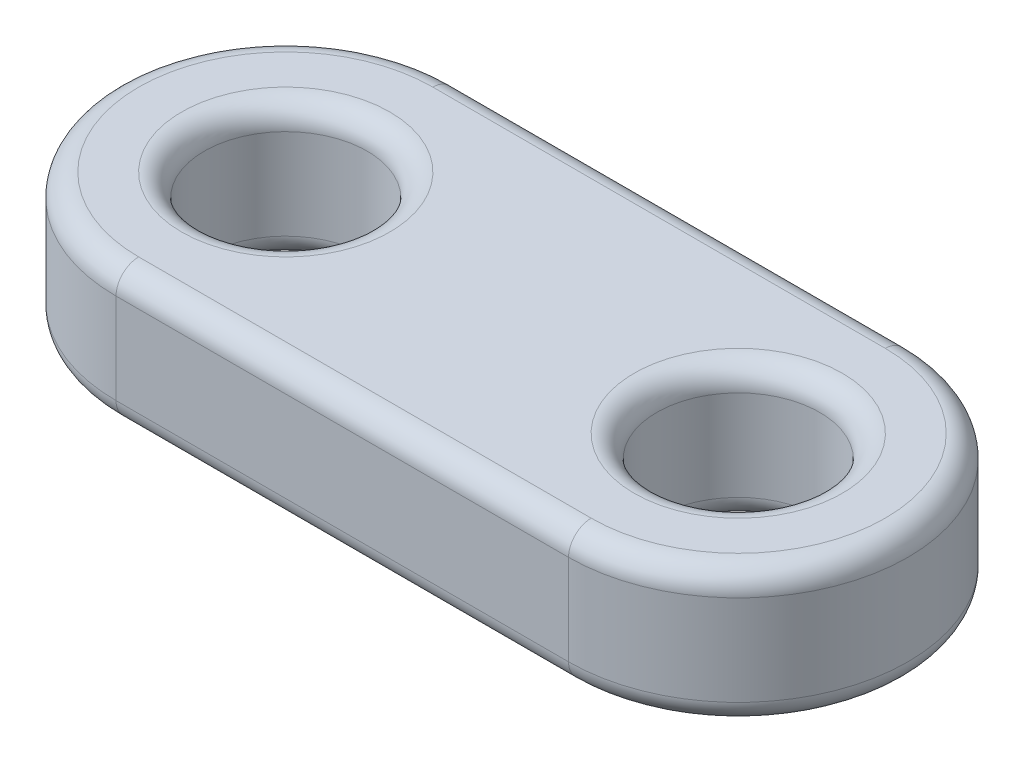
ISO-10303-21;
HEADER;
FILE_DESCRIPTION(('STEP AP214'),'2;1');
FILE_NAME('part.step','',(''),(''),'','','');
FILE_SCHEMA(('AUTOMOTIVE_DESIGN { 1 0 10303 214 1 1 1 1 }'));
ENDSEC;
DATA;
#1=APPLICATION_CONTEXT('core data for automotive mechanical design processes');
#2=APPLICATION_PROTOCOL_DEFINITION('international standard','automotive_design',2000,#1);
#3=PRODUCT_CONTEXT('',#1,'mechanical');
#4=PRODUCT('Part','Part','',(#3));
#5=PRODUCT_RELATED_PRODUCT_CATEGORY('part','',(#4));
#6=PRODUCT_DEFINITION_FORMATION('','',#4);
#7=PRODUCT_DEFINITION_CONTEXT('part definition',#1,'design');
#8=PRODUCT_DEFINITION('design','',#6,#7);
#9=PRODUCT_DEFINITION_SHAPE('','',#8);
#10=(LENGTH_UNIT() NAMED_UNIT(*) SI_UNIT(.MILLI.,.METRE.));
#11=(NAMED_UNIT(*) PLANE_ANGLE_UNIT() SI_UNIT($,.RADIAN.));
#12=(NAMED_UNIT(*) SI_UNIT($,.STERADIAN.) SOLID_ANGLE_UNIT());
#13=UNCERTAINTY_MEASURE_WITH_UNIT(LENGTH_MEASURE(1.E-05),#10,'distance_accuracy_value','');
#14=(GEOMETRIC_REPRESENTATION_CONTEXT(3) GLOBAL_UNCERTAINTY_ASSIGNED_CONTEXT((#13)) GLOBAL_UNIT_ASSIGNED_CONTEXT((#10,
#11,#12)) REPRESENTATION_CONTEXT('',''));
#15=CARTESIAN_POINT('',(0.,0.,0.));
#16=DIRECTION('',(0.,0.,1.));
#17=DIRECTION('',(1.,0.,0.));
#18=AXIS2_PLACEMENT_3D('',#15,#16,#17);
#19=CARTESIAN_POINT('',(-5.,3.,0.));
#20=DIRECTION('',(0.,-1.,0.));
#21=DIRECTION('',(0.,0.,-1.));
#22=AXIS2_PLACEMENT_3D('',#19,#20,#21);
#23=CYLINDRICAL_SURFACE('',#22,3.75);
#24=DIRECTION('',(0.,-1.,0.));
#25=VECTOR('',#24,1.);
#26=CARTESIAN_POINT('',(-5.,3.,-3.75));
#27=LINE('',#26,#25);
#28=CARTESIAN_POINT('',(-5.,2.5,-3.75));
#29=VERTEX_POINT('',#28);
#30=CARTESIAN_POINT('',(-5.,0.5,-3.75));
#31=VERTEX_POINT('',#30);
#32=EDGE_CURVE('E178',#29,#31,#27,.T.);
#33=ORIENTED_EDGE('',*,*,#32,.T.);
#34=CARTESIAN_POINT('',(-5.,0.5,0.));
#35=DIRECTION('',(0.,1.,0.));
#36=DIRECTION('',(0.,0.,1.));
#37=AXIS2_PLACEMENT_3D('',#34,#35,#36);
#38=CIRCLE('',#37,3.75);
#39=CARTESIAN_POINT('',(-5.,0.5,3.75));
#40=VERTEX_POINT('',#39);
#41=EDGE_CURVE('E215',#31,#40,#38,.T.);
#42=ORIENTED_EDGE('',*,*,#41,.T.);
#43=DIRECTION('',(0.,-1.,0.));
#44=VECTOR('',#43,1.);
#45=CARTESIAN_POINT('',(-5.,3.,3.75));
#46=LINE('',#45,#44);
#47=CARTESIAN_POINT('',(-5.,2.5,3.75));
#48=VERTEX_POINT('',#47);
#49=EDGE_CURVE('E146',#48,#40,#46,.T.);
#50=ORIENTED_EDGE('',*,*,#49,.F.);
#51=CARTESIAN_POINT('',(-5.,2.5,0.));
#52=DIRECTION('',(0.,1.,0.));
#53=DIRECTION('',(0.,0.,1.));
#54=AXIS2_PLACEMENT_3D('',#51,#52,#53);
#55=CIRCLE('',#54,3.75);
#56=EDGE_CURVE('E218',#48,#29,#55,.F.);
#57=ORIENTED_EDGE('',*,*,#56,.T.);
#58=EDGE_LOOP('',(#33,#42,#50,#57));
#59=FACE_BOUND('',#58,.T.);
#60=ADVANCED_FACE('F42',(#59),#23,.T.);
#61=CARTESIAN_POINT('',(-5.,3.,3.75));
#62=DIRECTION('',(0.,0.,-1.));
#63=DIRECTION('',(-1.,0.,0.));
#64=AXIS2_PLACEMENT_3D('',#61,#62,#63);
#65=PLANE('',#64);
#66=ORIENTED_EDGE('',*,*,#49,.T.);
#67=DIRECTION('',(1.,0.,0.));
#68=VECTOR('',#67,1.);
#69=CARTESIAN_POINT('',(-5.,0.5,3.75));
#70=LINE('',#69,#68);
#71=CARTESIAN_POINT('',(5.,0.5,3.75));
#72=VERTEX_POINT('',#71);
#73=EDGE_CURVE('E144',#40,#72,#70,.T.);
#74=ORIENTED_EDGE('',*,*,#73,.T.);
#75=DIRECTION('',(0.,-1.,0.));
#76=VECTOR('',#75,1.);
#77=CARTESIAN_POINT('',(5.,3.,3.75));
#78=LINE('',#77,#76);
#79=CARTESIAN_POINT('',(5.,2.5,3.75));
#80=VERTEX_POINT('',#79);
#81=EDGE_CURVE('E126',#80,#72,#78,.T.);
#82=ORIENTED_EDGE('',*,*,#81,.F.);
#83=DIRECTION('',(1.,0.,0.));
#84=VECTOR('',#83,1.);
#85=CARTESIAN_POINT('',(-5.,2.5,3.75));
#86=LINE('',#85,#84);
#87=EDGE_CURVE('E141',#80,#48,#86,.F.);
#88=ORIENTED_EDGE('',*,*,#87,.T.);
#89=EDGE_LOOP('',(#66,#74,#82,#88));
#90=FACE_BOUND('',#89,.T.);
#91=ADVANCED_FACE('F140',(#90),#65,.F.);
#92=CARTESIAN_POINT('',(5.,3.,0.));
#93=DIRECTION('',(0.,-1.,0.));
#94=DIRECTION('',(0.,0.,-1.));
#95=AXIS2_PLACEMENT_3D('',#92,#93,#94);
#96=CYLINDRICAL_SURFACE('',#95,3.75);
#97=ORIENTED_EDGE('',*,*,#81,.T.);
#98=CARTESIAN_POINT('',(5.,0.5,0.));
#99=DIRECTION('',(0.,1.,0.));
#100=DIRECTION('',(0.,0.,1.));
#101=AXIS2_PLACEMENT_3D('',#98,#99,#100);
#102=CIRCLE('',#101,3.75);
#103=CARTESIAN_POINT('',(5.,0.5,-3.75));
#104=VERTEX_POINT('',#103);
#105=EDGE_CURVE('E133',#72,#104,#102,.T.);
#106=ORIENTED_EDGE('',*,*,#105,.T.);
#107=DIRECTION('',(0.,-1.,0.));
#108=VECTOR('',#107,1.);
#109=CARTESIAN_POINT('',(5.,3.,-3.75));
#110=LINE('',#109,#108);
#111=CARTESIAN_POINT('',(5.,2.5,-3.75));
#112=VERTEX_POINT('',#111);
#113=EDGE_CURVE('E128',#112,#104,#110,.T.);
#114=ORIENTED_EDGE('',*,*,#113,.F.);
#115=CARTESIAN_POINT('',(5.,2.5,0.));
#116=DIRECTION('',(0.,1.,0.));
#117=DIRECTION('',(0.,0.,1.));
#118=AXIS2_PLACEMENT_3D('',#115,#116,#117);
#119=CIRCLE('',#118,3.75);
#120=EDGE_CURVE('E123',#112,#80,#119,.F.);
#121=ORIENTED_EDGE('',*,*,#120,.T.);
#122=EDGE_LOOP('',(#97,#106,#114,#121));
#123=FACE_BOUND('',#122,.T.);
#124=ADVANCED_FACE('F125',(#123),#96,.T.);
#125=CARTESIAN_POINT('',(-5.,3.,-3.75));
#126=DIRECTION('',(0.,0.,1.));
#127=DIRECTION('',(1.,0.,0.));
#128=AXIS2_PLACEMENT_3D('',#125,#126,#127);
#129=PLANE('',#128);
#130=ORIENTED_EDGE('',*,*,#113,.T.);
#131=DIRECTION('',(-1.,0.,0.));
#132=VECTOR('',#131,1.);
#133=CARTESIAN_POINT('',(-5.,0.5,-3.75));
#134=LINE('',#133,#132);
#135=EDGE_CURVE('E220',#104,#31,#134,.T.);
#136=ORIENTED_EDGE('',*,*,#135,.T.);
#137=ORIENTED_EDGE('',*,*,#32,.F.);
#138=DIRECTION('',(-1.,0.,0.));
#139=VECTOR('',#138,1.);
#140=CARTESIAN_POINT('',(5.,2.5,-3.75));
#141=LINE('',#140,#139);
#142=EDGE_CURVE('E223',#29,#112,#141,.F.);
#143=ORIENTED_EDGE('',*,*,#142,.T.);
#144=EDGE_LOOP('',(#130,#136,#137,#143));
#145=FACE_BOUND('',#144,.T.);
#146=ADVANCED_FACE('F278',(#145),#129,.F.);
#147=CARTESIAN_POINT('',(-5.,3.,0.));
#148=DIRECTION('',(0.,1.,0.));
#149=DIRECTION('',(0.,0.,1.));
#150=AXIS2_PLACEMENT_3D('',#147,#148,#149);
#151=PLANE('',#150);
#152=CARTESIAN_POINT('',(5.,3.,0.));
#153=DIRECTION('',(0.,1.,0.));
#154=DIRECTION('',(0.,0.,1.));
#155=AXIS2_PLACEMENT_3D('',#152,#153,#154);
#156=CIRCLE('',#155,3.25);
#157=CARTESIAN_POINT('',(5.,3.,3.25));
#158=VERTEX_POINT('',#157);
#159=CARTESIAN_POINT('',(5.,3.,-3.25));
#160=VERTEX_POINT('',#159);
#161=EDGE_CURVE('E52',#158,#160,#156,.T.);
#162=ORIENTED_EDGE('',*,*,#161,.T.);
#163=DIRECTION('',(-1.,0.,0.));
#164=VECTOR('',#163,1.);
#165=CARTESIAN_POINT('',(-5.,3.,-3.25));
#166=LINE('',#165,#164);
#167=CARTESIAN_POINT('',(-5.,3.,-3.25));
#168=VERTEX_POINT('',#167);
#169=EDGE_CURVE('E11',#160,#168,#166,.T.);
#170=ORIENTED_EDGE('',*,*,#169,.T.);
#171=CARTESIAN_POINT('',(-5.,3.,0.));
#172=DIRECTION('',(0.,1.,0.));
#173=DIRECTION('',(0.,0.,1.));
#174=AXIS2_PLACEMENT_3D('',#171,#172,#173);
#175=CIRCLE('',#174,3.25);
#176=CARTESIAN_POINT('',(-5.,3.,3.25));
#177=VERTEX_POINT('',#176);
#178=EDGE_CURVE('E189',#168,#177,#175,.T.);
#179=ORIENTED_EDGE('',*,*,#178,.T.);
#180=DIRECTION('',(1.,0.,0.));
#181=VECTOR('',#180,1.);
#182=CARTESIAN_POINT('',(5.,3.,3.25));
#183=LINE('',#182,#181);
#184=EDGE_CURVE('E69',#177,#158,#183,.T.);
#185=ORIENTED_EDGE('',*,*,#184,.T.);
#186=EDGE_LOOP('',(#162,#170,#179,#185));
#187=FACE_BOUND('',#186,.T.);
#188=CARTESIAN_POINT('',(5.,3.,0.));
#189=DIRECTION('',(0.,1.,0.));
#190=DIRECTION('',(0.,0.,1.));
#191=AXIS2_PLACEMENT_3D('',#188,#189,#190);
#192=CIRCLE('',#191,2.29999999999999);
#193=CARTESIAN_POINT('',(5.,3.,2.29999999999999));
#194=VERTEX_POINT('',#193);
#195=EDGE_CURVE('E191',#194,#194,#192,.F.);
#196=ORIENTED_EDGE('',*,*,#195,.T.);
#197=EDGE_LOOP('',(#196));
#198=FACE_BOUND('',#197,.T.);
#199=CARTESIAN_POINT('',(-5.,3.,0.));
#200=DIRECTION('',(0.,1.,0.));
#201=DIRECTION('',(0.,0.,1.));
#202=AXIS2_PLACEMENT_3D('',#199,#200,#201);
#203=CIRCLE('',#202,2.29999999999999);
#204=CARTESIAN_POINT('',(-5.,3.,2.29999999999999));
#205=VERTEX_POINT('',#204);
#206=EDGE_CURVE('E195',#205,#205,#203,.F.);
#207=ORIENTED_EDGE('',*,*,#206,.T.);
#208=EDGE_LOOP('',(#207));
#209=FACE_BOUND('',#208,.T.);
#210=ADVANCED_FACE('F284',(#187,#198,#209),#151,.T.);
#211=CARTESIAN_POINT('',(-5.,0.,0.));
#212=DIRECTION('',(0.,1.,0.));
#213=DIRECTION('',(0.,0.,1.));
#214=AXIS2_PLACEMENT_3D('',#211,#212,#213);
#215=PLANE('',#214);
#216=CARTESIAN_POINT('',(5.,0.,0.));
#217=DIRECTION('',(0.,1.,0.));
#218=DIRECTION('',(0.,0.,1.));
#219=AXIS2_PLACEMENT_3D('',#216,#217,#218);
#220=CIRCLE('',#219,3.25);
#221=CARTESIAN_POINT('',(5.,0.,-3.25));
#222=VERTEX_POINT('',#221);
#223=CARTESIAN_POINT('',(5.,0.,3.25));
#224=VERTEX_POINT('',#223);
#225=EDGE_CURVE('E231',#222,#224,#220,.F.);
#226=ORIENTED_EDGE('',*,*,#225,.T.);
#227=DIRECTION('',(1.,0.,0.));
#228=VECTOR('',#227,1.);
#229=CARTESIAN_POINT('',(-5.,0.,3.25));
#230=LINE('',#229,#228);
#231=CARTESIAN_POINT('',(-5.,0.,3.25));
#232=VERTEX_POINT('',#231);
#233=EDGE_CURVE('E134',#224,#232,#230,.F.);
#234=ORIENTED_EDGE('',*,*,#233,.T.);
#235=CARTESIAN_POINT('',(-5.,0.,0.));
#236=DIRECTION('',(0.,1.,0.));
#237=DIRECTION('',(0.,0.,1.));
#238=AXIS2_PLACEMENT_3D('',#235,#236,#237);
#239=CIRCLE('',#238,3.25);
#240=CARTESIAN_POINT('',(-5.,0.,-3.25));
#241=VERTEX_POINT('',#240);
#242=EDGE_CURVE('E237',#232,#241,#239,.F.);
#243=ORIENTED_EDGE('',*,*,#242,.T.);
#244=DIRECTION('',(-1.,0.,0.));
#245=VECTOR('',#244,1.);
#246=CARTESIAN_POINT('',(-5.,0.,-3.25));
#247=LINE('',#246,#245);
#248=EDGE_CURVE('E234',#241,#222,#247,.F.);
#249=ORIENTED_EDGE('',*,*,#248,.T.);
#250=EDGE_LOOP('',(#226,#234,#243,#249));
#251=FACE_BOUND('',#250,.T.);
#252=CARTESIAN_POINT('',(5.,0.,0.));
#253=DIRECTION('',(0.,1.,0.));
#254=DIRECTION('',(0.,0.,1.));
#255=AXIS2_PLACEMENT_3D('',#252,#253,#254);
#256=CIRCLE('',#255,2.29999999999999);
#257=CARTESIAN_POINT('',(5.,0.,2.29999999999999));
#258=VERTEX_POINT('',#257);
#259=EDGE_CURVE('E239',#258,#258,#256,.T.);
#260=ORIENTED_EDGE('',*,*,#259,.T.);
#261=EDGE_LOOP('',(#260));
#262=FACE_BOUND('',#261,.T.);
#263=CARTESIAN_POINT('',(-5.,0.,0.));
#264=DIRECTION('',(0.,1.,0.));
#265=DIRECTION('',(0.,0.,1.));
#266=AXIS2_PLACEMENT_3D('',#263,#264,#265);
#267=CIRCLE('',#266,2.29999999999999);
#268=CARTESIAN_POINT('',(-5.,0.,2.29999999999999));
#269=VERTEX_POINT('',#268);
#270=EDGE_CURVE('E243',#269,#269,#267,.T.);
#271=ORIENTED_EDGE('',*,*,#270,.T.);
#272=EDGE_LOOP('',(#271));
#273=FACE_BOUND('',#272,.T.);
#274=ADVANCED_FACE('F287',(#251,#262,#273),#215,.F.);
#275=CARTESIAN_POINT('',(5.,0.,0.));
#276=DIRECTION('',(0.,-1.,0.));
#277=DIRECTION('',(0.,0.,-1.));
#278=AXIS2_PLACEMENT_3D('',#275,#276,#277);
#279=CYLINDRICAL_SURFACE('',#278,1.79999999999999);
#280=CARTESIAN_POINT('',(5.,0.5,0.));
#281=DIRECTION('',(0.,1.,0.));
#282=DIRECTION('',(0.,0.,1.));
#283=AXIS2_PLACEMENT_3D('',#280,#281,#282);
#284=CIRCLE('',#283,1.79999999999999);
#285=CARTESIAN_POINT('',(5.,0.5,1.79999999999999));
#286=VERTEX_POINT('',#285);
#287=EDGE_CURVE('E207',#286,#286,#284,.F.);
#288=ORIENTED_EDGE('',*,*,#287,.T.);
#289=EDGE_LOOP('',(#288));
#290=FACE_BOUND('',#289,.T.);
#291=CARTESIAN_POINT('',(5.,2.5,0.));
#292=DIRECTION('',(0.,1.,0.));
#293=DIRECTION('',(0.,0.,1.));
#294=AXIS2_PLACEMENT_3D('',#291,#292,#293);
#295=CIRCLE('',#294,1.79999999999999);
#296=CARTESIAN_POINT('',(5.,2.5,1.79999999999999));
#297=VERTEX_POINT('',#296);
#298=EDGE_CURVE('E211',#297,#297,#295,.T.);
#299=ORIENTED_EDGE('',*,*,#298,.T.);
#300=EDGE_LOOP('',(#299));
#301=FACE_BOUND('',#300,.T.);
#302=ADVANCED_FACE('F381',(#290,#301),#279,.F.);
#303=CARTESIAN_POINT('',(-5.,0.,0.));
#304=DIRECTION('',(0.,-1.,0.));
#305=DIRECTION('',(0.,0.,-1.));
#306=AXIS2_PLACEMENT_3D('',#303,#304,#305);
#307=CYLINDRICAL_SURFACE('',#306,1.79999999999999);
#308=CARTESIAN_POINT('',(-5.,0.5,0.));
#309=DIRECTION('',(0.,1.,0.));
#310=DIRECTION('',(0.,0.,1.));
#311=AXIS2_PLACEMENT_3D('',#308,#309,#310);
#312=CIRCLE('',#311,1.79999999999999);
#313=CARTESIAN_POINT('',(-5.,0.5,1.79999999999999));
#314=VERTEX_POINT('',#313);
#315=EDGE_CURVE('E199',#314,#314,#312,.F.);
#316=ORIENTED_EDGE('',*,*,#315,.T.);
#317=EDGE_LOOP('',(#316));
#318=FACE_BOUND('',#317,.T.);
#319=CARTESIAN_POINT('',(-5.,2.5,0.));
#320=DIRECTION('',(0.,1.,0.));
#321=DIRECTION('',(0.,0.,1.));
#322=AXIS2_PLACEMENT_3D('',#319,#320,#321);
#323=CIRCLE('',#322,1.79999999999999);
#324=CARTESIAN_POINT('',(-5.,2.5,1.79999999999999));
#325=VERTEX_POINT('',#324);
#326=EDGE_CURVE('E203',#325,#325,#323,.T.);
#327=ORIENTED_EDGE('',*,*,#326,.T.);
#328=EDGE_LOOP('',(#327));
#329=FACE_BOUND('',#328,.T.);
#330=ADVANCED_FACE('F318',(#318,#329),#307,.F.);
#331=CARTESIAN_POINT('',(-5.,0.5,-3.25));
#332=DIRECTION('',(-1.,0.,0.));
#333=DIRECTION('',(0.,0.,1.));
#334=AXIS2_PLACEMENT_3D('',#331,#332,#333);
#335=CYLINDRICAL_SURFACE('',#334,0.5);
#336=CARTESIAN_POINT('',(5.,0.5,-3.25));
#337=DIRECTION('',(1.,0.,0.));
#338=DIRECTION('',(0.,0.,-1.));
#339=AXIS2_PLACEMENT_3D('',#336,#337,#338);
#340=CIRCLE('',#339,0.5);
#341=EDGE_CURVE('E179',#222,#104,#340,.T.);
#342=ORIENTED_EDGE('',*,*,#341,.F.);
#343=ORIENTED_EDGE('',*,*,#248,.F.);
#344=CARTESIAN_POINT('',(-5.,0.5,-3.25));
#345=DIRECTION('',(-1.,0.,0.));
#346=DIRECTION('',(0.,0.,1.));
#347=AXIS2_PLACEMENT_3D('',#344,#345,#346);
#348=CIRCLE('',#347,0.5);
#349=EDGE_CURVE('E175',#31,#241,#348,.T.);
#350=ORIENTED_EDGE('',*,*,#349,.F.);
#351=ORIENTED_EDGE('',*,*,#135,.F.);
#352=EDGE_LOOP('',(#342,#343,#350,#351));
#353=FACE_BOUND('',#352,.T.);
#354=ADVANCED_FACE('F265',(#353),#335,.T.);
#355=CARTESIAN_POINT('',(-5.,0.5,0.));
#356=DIRECTION('',(0.,1.,0.));
#357=DIRECTION('',(0.,0.,1.));
#358=AXIS2_PLACEMENT_3D('',#355,#356,#357);
#359=TOROIDAL_SURFACE('',#358,3.25,0.5);
#360=ORIENTED_EDGE('',*,*,#349,.T.);
#361=ORIENTED_EDGE('',*,*,#242,.F.);
#362=CARTESIAN_POINT('',(-5.,0.5,3.25));
#363=DIRECTION('',(1.,0.,0.));
#364=DIRECTION('',(0.,0.,-1.));
#365=AXIS2_PLACEMENT_3D('',#362,#363,#364);
#366=CIRCLE('',#365,0.5);
#367=EDGE_CURVE('E161',#40,#232,#366,.T.);
#368=ORIENTED_EDGE('',*,*,#367,.F.);
#369=ORIENTED_EDGE('',*,*,#41,.F.);
#370=EDGE_LOOP('',(#360,#361,#368,#369));
#371=FACE_BOUND('',#370,.T.);
#372=ADVANCED_FACE('F269',(#371),#359,.T.);
#373=CARTESIAN_POINT('',(5.,0.5,0.));
#374=DIRECTION('',(0.,1.,0.));
#375=DIRECTION('',(0.,0.,1.));
#376=AXIS2_PLACEMENT_3D('',#373,#374,#375);
#377=TOROIDAL_SURFACE('',#376,3.25,0.5);
#378=ORIENTED_EDGE('',*,*,#341,.T.);
#379=ORIENTED_EDGE('',*,*,#105,.F.);
#380=CARTESIAN_POINT('',(5.,0.5,3.25));
#381=DIRECTION('',(-1.,0.,0.));
#382=DIRECTION('',(0.,0.,1.));
#383=AXIS2_PLACEMENT_3D('',#380,#381,#382);
#384=CIRCLE('',#383,0.5);
#385=EDGE_CURVE('E158',#224,#72,#384,.T.);
#386=ORIENTED_EDGE('',*,*,#385,.F.);
#387=ORIENTED_EDGE('',*,*,#225,.F.);
#388=EDGE_LOOP('',(#378,#379,#386,#387));
#389=FACE_BOUND('',#388,.T.);
#390=ADVANCED_FACE('F277',(#389),#377,.T.);
#391=CARTESIAN_POINT('',(-5.,0.5,3.25));
#392=DIRECTION('',(1.,0.,0.));
#393=DIRECTION('',(0.,0.,-1.));
#394=AXIS2_PLACEMENT_3D('',#391,#392,#393);
#395=CYLINDRICAL_SURFACE('',#394,0.5);
#396=ORIENTED_EDGE('',*,*,#367,.T.);
#397=ORIENTED_EDGE('',*,*,#233,.F.);
#398=ORIENTED_EDGE('',*,*,#385,.T.);
#399=ORIENTED_EDGE('',*,*,#73,.F.);
#400=EDGE_LOOP('',(#396,#397,#398,#399));
#401=FACE_BOUND('',#400,.T.);
#402=ADVANCED_FACE('F272',(#401),#395,.T.);
#403=CARTESIAN_POINT('',(5.,0.5,0.));
#404=DIRECTION('',(0.,1.,0.));
#405=DIRECTION('',(0.,0.,1.));
#406=AXIS2_PLACEMENT_3D('',#403,#404,#405);
#407=TOROIDAL_SURFACE('',#406,2.29999999999999,0.5);
#408=ORIENTED_EDGE('',*,*,#259,.F.);
#409=EDGE_LOOP('',(#408));
#410=FACE_BOUND('',#409,.T.);
#411=ORIENTED_EDGE('',*,*,#287,.F.);
#412=EDGE_LOOP('',(#411));
#413=FACE_BOUND('',#412,.T.);
#414=ADVANCED_FACE('F311',(#410,#413),#407,.T.);
#415=CARTESIAN_POINT('',(-5.,0.5,0.));
#416=DIRECTION('',(0.,1.,0.));
#417=DIRECTION('',(0.,0.,1.));
#418=AXIS2_PLACEMENT_3D('',#415,#416,#417);
#419=TOROIDAL_SURFACE('',#418,2.29999999999999,0.5);
#420=ORIENTED_EDGE('',*,*,#270,.F.);
#421=EDGE_LOOP('',(#420));
#422=FACE_BOUND('',#421,.T.);
#423=ORIENTED_EDGE('',*,*,#315,.F.);
#424=EDGE_LOOP('',(#423));
#425=FACE_BOUND('',#424,.T.);
#426=ADVANCED_FACE('F321',(#422,#425),#419,.T.);
#427=CARTESIAN_POINT('',(-5.,2.5,3.25));
#428=DIRECTION('',(-1.,0.,0.));
#429=DIRECTION('',(0.,0.,1.));
#430=AXIS2_PLACEMENT_3D('',#427,#428,#429);
#431=CYLINDRICAL_SURFACE('',#430,0.5);
#432=CARTESIAN_POINT('',(-5.,2.5,3.25));
#433=DIRECTION('',(-1.,0.,0.));
#434=DIRECTION('',(0.,0.,1.));
#435=AXIS2_PLACEMENT_3D('',#432,#433,#434);
#436=CIRCLE('',#435,0.5);
#437=EDGE_CURVE('E152',#48,#177,#436,.T.);
#438=ORIENTED_EDGE('',*,*,#437,.F.);
#439=ORIENTED_EDGE('',*,*,#87,.F.);
#440=CARTESIAN_POINT('',(5.,2.5,3.25));
#441=DIRECTION('',(1.,0.,0.));
#442=DIRECTION('',(0.,0.,-1.));
#443=AXIS2_PLACEMENT_3D('',#440,#441,#442);
#444=CIRCLE('',#443,0.5);
#445=EDGE_CURVE('E46',#158,#80,#444,.T.);
#446=ORIENTED_EDGE('',*,*,#445,.F.);
#447=ORIENTED_EDGE('',*,*,#184,.F.);
#448=EDGE_LOOP('',(#438,#439,#446,#447));
#449=FACE_BOUND('',#448,.T.);
#450=ADVANCED_FACE('F150',(#449),#431,.T.);
#451=CARTESIAN_POINT('',(5.,2.5,0.));
#452=DIRECTION('',(0.,1.,0.));
#453=DIRECTION('',(0.,0.,1.));
#454=AXIS2_PLACEMENT_3D('',#451,#452,#453);
#455=TOROIDAL_SURFACE('',#454,3.25,0.5);
#456=ORIENTED_EDGE('',*,*,#445,.T.);
#457=ORIENTED_EDGE('',*,*,#120,.F.);
#458=CARTESIAN_POINT('',(5.,2.5,-3.25));
#459=DIRECTION('',(-1.,0.,0.));
#460=DIRECTION('',(0.,0.,1.));
#461=AXIS2_PLACEMENT_3D('',#458,#459,#460);
#462=CIRCLE('',#461,0.5);
#463=EDGE_CURVE('E164',#160,#112,#462,.T.);
#464=ORIENTED_EDGE('',*,*,#463,.F.);
#465=ORIENTED_EDGE('',*,*,#161,.F.);
#466=EDGE_LOOP('',(#456,#457,#464,#465));
#467=FACE_BOUND('',#466,.T.);
#468=ADVANCED_FACE('F156',(#467),#455,.T.);
#469=CARTESIAN_POINT('',(-5.,2.5,0.));
#470=DIRECTION('',(0.,1.,0.));
#471=DIRECTION('',(0.,0.,1.));
#472=AXIS2_PLACEMENT_3D('',#469,#470,#471);
#473=TOROIDAL_SURFACE('',#472,3.25,0.5);
#474=ORIENTED_EDGE('',*,*,#437,.T.);
#475=ORIENTED_EDGE('',*,*,#178,.F.);
#476=CARTESIAN_POINT('',(-5.,2.5,-3.25));
#477=DIRECTION('',(1.,0.,0.));
#478=DIRECTION('',(0.,0.,-1.));
#479=AXIS2_PLACEMENT_3D('',#476,#477,#478);
#480=CIRCLE('',#479,0.5);
#481=EDGE_CURVE('E170',#29,#168,#480,.T.);
#482=ORIENTED_EDGE('',*,*,#481,.F.);
#483=ORIENTED_EDGE('',*,*,#56,.F.);
#484=EDGE_LOOP('',(#474,#475,#482,#483));
#485=FACE_BOUND('',#484,.T.);
#486=ADVANCED_FACE('F283',(#485),#473,.T.);
#487=CARTESIAN_POINT('',(-5.,2.5,-3.25));
#488=DIRECTION('',(1.,0.,0.));
#489=DIRECTION('',(0.,0.,-1.));
#490=AXIS2_PLACEMENT_3D('',#487,#488,#489);
#491=CYLINDRICAL_SURFACE('',#490,0.5);
#492=ORIENTED_EDGE('',*,*,#463,.T.);
#493=ORIENTED_EDGE('',*,*,#142,.F.);
#494=ORIENTED_EDGE('',*,*,#481,.T.);
#495=ORIENTED_EDGE('',*,*,#169,.F.);
#496=EDGE_LOOP('',(#492,#493,#494,#495));
#497=FACE_BOUND('',#496,.T.);
#498=ADVANCED_FACE('F281',(#497),#491,.T.);
#499=CARTESIAN_POINT('',(5.,2.5,0.));
#500=DIRECTION('',(0.,1.,0.));
#501=DIRECTION('',(0.,0.,1.));
#502=AXIS2_PLACEMENT_3D('',#499,#500,#501);
#503=TOROIDAL_SURFACE('',#502,2.29999999999999,0.5);
#504=ORIENTED_EDGE('',*,*,#298,.F.);
#505=EDGE_LOOP('',(#504));
#506=FACE_BOUND('',#505,.T.);
#507=ORIENTED_EDGE('',*,*,#195,.F.);
#508=EDGE_LOOP('',(#507));
#509=FACE_BOUND('',#508,.T.);
#510=ADVANCED_FACE('F294',(#506,#509),#503,.T.);
#511=CARTESIAN_POINT('',(-5.,2.5,0.));
#512=DIRECTION('',(0.,1.,0.));
#513=DIRECTION('',(0.,0.,1.));
#514=AXIS2_PLACEMENT_3D('',#511,#512,#513);
#515=TOROIDAL_SURFACE('',#514,2.29999999999999,0.5);
#516=ORIENTED_EDGE('',*,*,#326,.F.);
#517=EDGE_LOOP('',(#516));
#518=FACE_BOUND('',#517,.T.);
#519=ORIENTED_EDGE('',*,*,#206,.F.);
#520=EDGE_LOOP('',(#519));
#521=FACE_BOUND('',#520,.T.);
#522=ADVANCED_FACE('F44',(#518,#521),#515,.T.);
#523=CLOSED_SHELL('',(#60,#91,#124,#146,#210,#274,#302,#330,#354,#372,#390,#402,#414,#426,#450,
#468,#486,#498,#510,#522));
#524=MANIFOLD_SOLID_BREP('B2',#523);
#525=ADVANCED_BREP_SHAPE_REPRESENTATION('',(#18,#524),#14);
#526=SHAPE_DEFINITION_REPRESENTATION(#9,#525);
ENDSEC;
END-ISO-10303-21;
